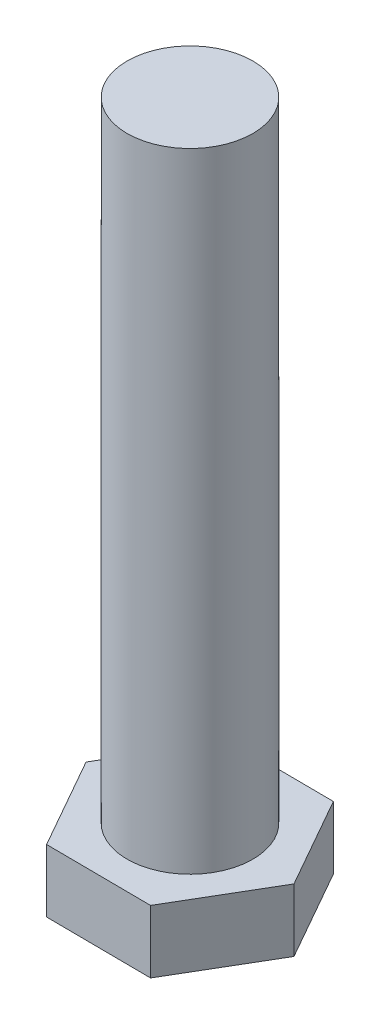
ISO-10303-21;
HEADER;
FILE_DESCRIPTION(('STEP AP214'),'2;1');
FILE_NAME('part.step','',(''),(''),'','','');
FILE_SCHEMA(('AUTOMOTIVE_DESIGN { 1 0 10303 214 1 1 1 1 }'));
ENDSEC;
DATA;
#1=APPLICATION_CONTEXT('core data for automotive mechanical design processes');
#2=APPLICATION_PROTOCOL_DEFINITION('international standard','automotive_design',2000,#1);
#3=PRODUCT_CONTEXT('',#1,'mechanical');
#4=PRODUCT('Part','Part','',(#3));
#5=PRODUCT_RELATED_PRODUCT_CATEGORY('part','',(#4));
#6=PRODUCT_DEFINITION_FORMATION('','',#4);
#7=PRODUCT_DEFINITION_CONTEXT('part definition',#1,'design');
#8=PRODUCT_DEFINITION('design','',#6,#7);
#9=PRODUCT_DEFINITION_SHAPE('','',#8);
#10=(LENGTH_UNIT() NAMED_UNIT(*) SI_UNIT(.MILLI.,.METRE.));
#11=(NAMED_UNIT(*) PLANE_ANGLE_UNIT() SI_UNIT($,.RADIAN.));
#12=(NAMED_UNIT(*) SI_UNIT($,.STERADIAN.) SOLID_ANGLE_UNIT());
#13=UNCERTAINTY_MEASURE_WITH_UNIT(LENGTH_MEASURE(1.E-05),#10,'distance_accuracy_value','');
#14=(GEOMETRIC_REPRESENTATION_CONTEXT(3) GLOBAL_UNCERTAINTY_ASSIGNED_CONTEXT((#13)) GLOBAL_UNIT_ASSIGNED_CONTEXT((#10,
#11,#12)) REPRESENTATION_CONTEXT('',''));
#15=CARTESIAN_POINT('',(0.,0.,0.));
#16=DIRECTION('',(0.,0.,1.));
#17=DIRECTION('',(1.,0.,0.));
#18=AXIS2_PLACEMENT_3D('',#15,#16,#17);
#19=CARTESIAN_POINT('',(0.,15.,0.));
#20=DIRECTION('',(0.,-1.,0.));
#21=DIRECTION('',(0.,0.,-1.));
#22=AXIS2_PLACEMENT_3D('',#19,#20,#21);
#23=CYLINDRICAL_SURFACE('',#22,1.5);
#24=CARTESIAN_POINT('',(0.,15.,0.));
#25=DIRECTION('',(0.,1.,0.));
#26=DIRECTION('',(0.,0.,1.));
#27=AXIS2_PLACEMENT_3D('',#24,#25,#26);
#28=CIRCLE('',#27,1.5);
#29=CARTESIAN_POINT('',(0.,15.,1.5));
#30=VERTEX_POINT('',#29);
#31=EDGE_CURVE('E11',#30,#30,#28,.T.);
#32=ORIENTED_EDGE('',*,*,#31,.F.);
#33=EDGE_LOOP('',(#32));
#34=FACE_BOUND('',#33,.T.);
#35=CARTESIAN_POINT('',(0.,0.,0.));
#36=DIRECTION('',(0.,-1.,0.));
#37=DIRECTION('',(0.,0.,-1.));
#38=AXIS2_PLACEMENT_3D('',#35,#36,#37);
#39=CIRCLE('',#38,1.5);
#40=CARTESIAN_POINT('',(0.,0.,-1.5));
#41=VERTEX_POINT('',#40);
#42=EDGE_CURVE('E41',#41,#41,#39,.T.);
#43=ORIENTED_EDGE('',*,*,#42,.F.);
#44=EDGE_LOOP('',(#43));
#45=FACE_BOUND('',#44,.T.);
#46=ADVANCED_FACE('F33',(#34,#45),#23,.T.);
#47=CARTESIAN_POINT('',(0.,15.,0.));
#48=DIRECTION('',(0.,1.,0.));
#49=DIRECTION('',(0.,0.,1.));
#50=AXIS2_PLACEMENT_3D('',#47,#48,#49);
#51=PLANE('',#50);
#52=ORIENTED_EDGE('',*,*,#31,.T.);
#53=EDGE_LOOP('',(#52));
#54=FACE_BOUND('',#53,.T.);
#55=ADVANCED_FACE('F143',(#54),#51,.T.);
#56=CARTESIAN_POINT('',(1.26636513009753,-1.5,-2.15561509719396));
#57=DIRECTION('',(-0.869779921870773,0.,0.493439851968274));
#58=DIRECTION('',(0.493439851968274,0.,0.869779921870773));
#59=AXIS2_PLACEMENT_3D('',#56,#57,#58);
#60=PLANE('',#59);
#61=DIRECTION('',(0.493439851968274,0.,0.869779921870773));
#62=VECTOR('',#61,1.);
#63=CARTESIAN_POINT('',(1.26636513009753,0.,-2.15561509719396));
#64=LINE('',#63,#62);
#65=CARTESIAN_POINT('',(1.26636513009753,0.,-2.15561509719396));
#66=VERTEX_POINT('',#65);
#67=CARTESIAN_POINT('',(2.5,0.,0.0188968245342703));
#68=VERTEX_POINT('',#67);
#69=EDGE_CURVE('E118',#66,#68,#64,.T.);
#70=ORIENTED_EDGE('',*,*,#69,.T.);
#71=DIRECTION('',(0.,1.,0.));
#72=VECTOR('',#71,1.);
#73=CARTESIAN_POINT('',(2.5,-1.5,0.0188968245342703));
#74=LINE('',#73,#72);
#75=CARTESIAN_POINT('',(2.5,-1.5,0.0188968245342703));
#76=VERTEX_POINT('',#75);
#77=EDGE_CURVE('E135',#76,#68,#74,.T.);
#78=ORIENTED_EDGE('',*,*,#77,.F.);
#79=DIRECTION('',(0.493439851968274,0.,0.869779921870773));
#80=VECTOR('',#79,1.);
#81=CARTESIAN_POINT('',(1.26636513009753,-1.5,-2.15561509719396));
#82=LINE('',#81,#80);
#83=CARTESIAN_POINT('',(1.26636513009753,-1.5,-2.15561509719396));
#84=VERTEX_POINT('',#83);
#85=EDGE_CURVE('E128',#84,#76,#82,.T.);
#86=ORIENTED_EDGE('',*,*,#85,.F.);
#87=DIRECTION('',(0.,1.,0.));
#88=VECTOR('',#87,1.);
#89=CARTESIAN_POINT('',(1.26636513009753,-1.5,-2.15561509719396));
#90=LINE('',#89,#88);
#91=EDGE_CURVE('E114',#84,#66,#90,.T.);
#92=ORIENTED_EDGE('',*,*,#91,.T.);
#93=EDGE_LOOP('',(#70,#78,#86,#92));
#94=FACE_BOUND('',#93,.T.);
#95=ADVANCED_FACE('F148',(#94),#60,.F.);
#96=CARTESIAN_POINT('',(2.5,-1.5,0.0188968245342703));
#97=DIRECTION('',(-0.862221407979545,0.,-0.506531582057596));
#98=DIRECTION('',(-0.506531582057596,0.,0.862221407979545));
#99=AXIS2_PLACEMENT_3D('',#96,#97,#98);
#100=PLANE('',#99);
#101=DIRECTION('',(-0.506531582057596,0.,0.862221407979545));
#102=VECTOR('',#101,1.);
#103=CARTESIAN_POINT('',(2.5,0.,0.0188968245342703));
#104=LINE('',#103,#102);
#105=CARTESIAN_POINT('',(1.23363486990247,0.,2.17451192172823));
#106=VERTEX_POINT('',#105);
#107=EDGE_CURVE('E121',#68,#106,#104,.T.);
#108=ORIENTED_EDGE('',*,*,#107,.T.);
#109=DIRECTION('',(0.,1.,0.));
#110=VECTOR('',#109,1.);
#111=CARTESIAN_POINT('',(1.23363486990247,-1.5,2.17451192172823));
#112=LINE('',#111,#110);
#113=CARTESIAN_POINT('',(1.23363486990247,-1.5,2.17451192172823));
#114=VERTEX_POINT('',#113);
#115=EDGE_CURVE('E132',#114,#106,#112,.T.);
#116=ORIENTED_EDGE('',*,*,#115,.F.);
#117=DIRECTION('',(-0.506531582057596,0.,0.862221407979545));
#118=VECTOR('',#117,1.);
#119=CARTESIAN_POINT('',(2.5,-1.5,0.0188968245342703));
#120=LINE('',#119,#118);
#121=EDGE_CURVE('E87',#76,#114,#120,.T.);
#122=ORIENTED_EDGE('',*,*,#121,.F.);
#123=ORIENTED_EDGE('',*,*,#77,.T.);
#124=EDGE_LOOP('',(#108,#116,#122,#123));
#125=FACE_BOUND('',#124,.T.);
#126=ADVANCED_FACE('F154',(#125),#100,.F.);
#127=CARTESIAN_POINT('',(1.23363486990247,-1.5,2.17451192172823));
#128=DIRECTION('',(0.00755851389122729,0.,-0.999971434025871));
#129=DIRECTION('',(-0.999971434025871,0.,-0.00755851389122729));
#130=AXIS2_PLACEMENT_3D('',#127,#128,#129);
#131=PLANE('',#130);
#132=DIRECTION('',(-0.999971434025871,0.,-0.00755851389122729));
#133=VECTOR('',#132,1.);
#134=CARTESIAN_POINT('',(1.23363486990247,0.,2.17451192172823));
#135=LINE('',#134,#133);
#136=CARTESIAN_POINT('',(-1.26636513009753,0.,2.15561509719396));
#137=VERTEX_POINT('',#136);
#138=EDGE_CURVE('E123',#106,#137,#135,.T.);
#139=ORIENTED_EDGE('',*,*,#138,.T.);
#140=DIRECTION('',(0.,1.,0.));
#141=VECTOR('',#140,1.);
#142=CARTESIAN_POINT('',(-1.26636513009753,-1.5,2.15561509719396));
#143=LINE('',#142,#141);
#144=CARTESIAN_POINT('',(-1.26636513009753,-1.5,2.15561509719396));
#145=VERTEX_POINT('',#144);
#146=EDGE_CURVE('E109',#145,#137,#143,.T.);
#147=ORIENTED_EDGE('',*,*,#146,.F.);
#148=DIRECTION('',(-0.999971434025871,0.,-0.00755851389122729));
#149=VECTOR('',#148,1.);
#150=CARTESIAN_POINT('',(1.23363486990247,-1.5,2.17451192172823));
#151=LINE('',#150,#149);
#152=EDGE_CURVE('E100',#114,#145,#151,.T.);
#153=ORIENTED_EDGE('',*,*,#152,.F.);
#154=ORIENTED_EDGE('',*,*,#115,.T.);
#155=EDGE_LOOP('',(#139,#147,#153,#154));
#156=FACE_BOUND('',#155,.T.);
#157=ADVANCED_FACE('F160',(#156),#131,.F.);
#158=CARTESIAN_POINT('',(-1.26636513009753,-1.5,2.15561509719396));
#159=DIRECTION('',(0.869779921870773,0.,-0.493439851968275));
#160=DIRECTION('',(-0.493439851968275,0.,-0.869779921870773));
#161=AXIS2_PLACEMENT_3D('',#158,#159,#160);
#162=PLANE('',#161);
#163=DIRECTION('',(-0.493439851968275,0.,-0.869779921870773));
#164=VECTOR('',#163,1.);
#165=CARTESIAN_POINT('',(-1.26636513009753,0.,2.15561509719396));
#166=LINE('',#165,#164);
#167=CARTESIAN_POINT('',(-2.5,0.,-0.0188968245342696));
#168=VERTEX_POINT('',#167);
#169=EDGE_CURVE('E108',#137,#168,#166,.T.);
#170=ORIENTED_EDGE('',*,*,#169,.T.);
#171=DIRECTION('',(0.,1.,0.));
#172=VECTOR('',#171,1.);
#173=CARTESIAN_POINT('',(-2.5,-1.5,-0.0188968245342696));
#174=LINE('',#173,#172);
#175=CARTESIAN_POINT('',(-2.5,-1.5,-0.0188968245342696));
#176=VERTEX_POINT('',#175);
#177=EDGE_CURVE('E105',#176,#168,#174,.T.);
#178=ORIENTED_EDGE('',*,*,#177,.F.);
#179=DIRECTION('',(-0.493439851968275,0.,-0.869779921870773));
#180=VECTOR('',#179,1.);
#181=CARTESIAN_POINT('',(-1.26636513009753,-1.5,2.15561509719396));
#182=LINE('',#181,#180);
#183=EDGE_CURVE('E94',#145,#176,#182,.T.);
#184=ORIENTED_EDGE('',*,*,#183,.F.);
#185=ORIENTED_EDGE('',*,*,#146,.T.);
#186=EDGE_LOOP('',(#170,#178,#184,#185));
#187=FACE_BOUND('',#186,.T.);
#188=ADVANCED_FACE('F106',(#187),#162,.F.);
#189=CARTESIAN_POINT('',(-2.5,-1.5,-0.0188968245342696));
#190=DIRECTION('',(0.862221407979545,0.,0.506531582057596));
#191=DIRECTION('',(0.506531582057596,0.,-0.862221407979545));
#192=AXIS2_PLACEMENT_3D('',#189,#190,#191);
#193=PLANE('',#192);
#194=DIRECTION('',(0.506531582057596,0.,-0.862221407979545));
#195=VECTOR('',#194,1.);
#196=CARTESIAN_POINT('',(-2.5,0.,-0.0188968245342696));
#197=LINE('',#196,#195);
#198=CARTESIAN_POINT('',(-1.23363486990247,0.,-2.17451192172823));
#199=VERTEX_POINT('',#198);
#200=EDGE_CURVE('E72',#168,#199,#197,.T.);
#201=ORIENTED_EDGE('',*,*,#200,.T.);
#202=DIRECTION('',(0.,1.,0.));
#203=VECTOR('',#202,1.);
#204=CARTESIAN_POINT('',(-1.23363486990247,-1.5,-2.17451192172823));
#205=LINE('',#204,#203);
#206=CARTESIAN_POINT('',(-1.23363486990247,-1.5,-2.17451192172823));
#207=VERTEX_POINT('',#206);
#208=EDGE_CURVE('E110',#207,#199,#205,.T.);
#209=ORIENTED_EDGE('',*,*,#208,.F.);
#210=DIRECTION('',(0.506531582057596,0.,-0.862221407979545));
#211=VECTOR('',#210,1.);
#212=CARTESIAN_POINT('',(-2.5,-1.5,-0.0188968245342696));
#213=LINE('',#212,#211);
#214=EDGE_CURVE('E98',#176,#207,#213,.T.);
#215=ORIENTED_EDGE('',*,*,#214,.F.);
#216=ORIENTED_EDGE('',*,*,#177,.T.);
#217=EDGE_LOOP('',(#201,#209,#215,#216));
#218=FACE_BOUND('',#217,.T.);
#219=ADVANCED_FACE('F112',(#218),#193,.F.);
#220=CARTESIAN_POINT('',(-1.23363486990247,-1.5,-2.17451192172823));
#221=DIRECTION('',(-0.00755851389122764,0.,0.999971434025871));
#222=DIRECTION('',(0.999971434025871,0.,0.00755851389122764));
#223=AXIS2_PLACEMENT_3D('',#220,#221,#222);
#224=PLANE('',#223);
#225=DIRECTION('',(0.999971434025871,0.,0.00755851389122764));
#226=VECTOR('',#225,1.);
#227=CARTESIAN_POINT('',(-1.23363486990247,0.,-2.17451192172823));
#228=LINE('',#227,#226);
#229=EDGE_CURVE('E78',#199,#66,#228,.T.);
#230=ORIENTED_EDGE('',*,*,#229,.T.);
#231=ORIENTED_EDGE('',*,*,#91,.F.);
#232=DIRECTION('',(0.999971434025871,0.,0.00755851389122764));
#233=VECTOR('',#232,1.);
#234=CARTESIAN_POINT('',(-1.23363486990247,-1.5,-2.17451192172823));
#235=LINE('',#234,#233);
#236=EDGE_CURVE('E49',#207,#84,#235,.T.);
#237=ORIENTED_EDGE('',*,*,#236,.F.);
#238=ORIENTED_EDGE('',*,*,#208,.T.);
#239=EDGE_LOOP('',(#230,#231,#237,#238));
#240=FACE_BOUND('',#239,.T.);
#241=ADVANCED_FACE('F168',(#240),#224,.F.);
#242=CARTESIAN_POINT('',(0.,-1.5,0.));
#243=DIRECTION('',(0.,-1.,0.));
#244=DIRECTION('',(0.,0.,-1.));
#245=AXIS2_PLACEMENT_3D('',#242,#243,#244);
#246=PLANE('',#245);
#247=ORIENTED_EDGE('',*,*,#85,.T.);
#248=ORIENTED_EDGE('',*,*,#121,.T.);
#249=ORIENTED_EDGE('',*,*,#152,.T.);
#250=ORIENTED_EDGE('',*,*,#183,.T.);
#251=ORIENTED_EDGE('',*,*,#214,.T.);
#252=ORIENTED_EDGE('',*,*,#236,.T.);
#253=EDGE_LOOP('',(#247,#248,#249,#250,#251,#252));
#254=FACE_BOUND('',#253,.T.);
#255=ADVANCED_FACE('F96',(#254),#246,.T.);
#256=CARTESIAN_POINT('',(0.,0.,0.));
#257=DIRECTION('',(0.,-1.,0.));
#258=DIRECTION('',(0.,0.,-1.));
#259=AXIS2_PLACEMENT_3D('',#256,#257,#258);
#260=PLANE('',#259);
#261=ORIENTED_EDGE('',*,*,#42,.T.);
#262=EDGE_LOOP('',(#261));
#263=FACE_BOUND('',#262,.T.);
#264=ORIENTED_EDGE('',*,*,#69,.F.);
#265=ORIENTED_EDGE('',*,*,#229,.F.);
#266=ORIENTED_EDGE('',*,*,#200,.F.);
#267=ORIENTED_EDGE('',*,*,#169,.F.);
#268=ORIENTED_EDGE('',*,*,#138,.F.);
#269=ORIENTED_EDGE('',*,*,#107,.F.);
#270=EDGE_LOOP('',(#264,#265,#266,#267,#268,#269));
#271=FACE_BOUND('',#270,.T.);
#272=ADVANCED_FACE('F139',(#263,#271),#260,.F.);
#273=CLOSED_SHELL('',(#46,#55,#95,#126,#157,#188,#219,#241,#255,#272));
#274=MANIFOLD_SOLID_BREP('B2',#273);
#275=ADVANCED_BREP_SHAPE_REPRESENTATION('',(#18,#274),#14);
#276=SHAPE_DEFINITION_REPRESENTATION(#9,#275);
ENDSEC;
END-ISO-10303-21;
